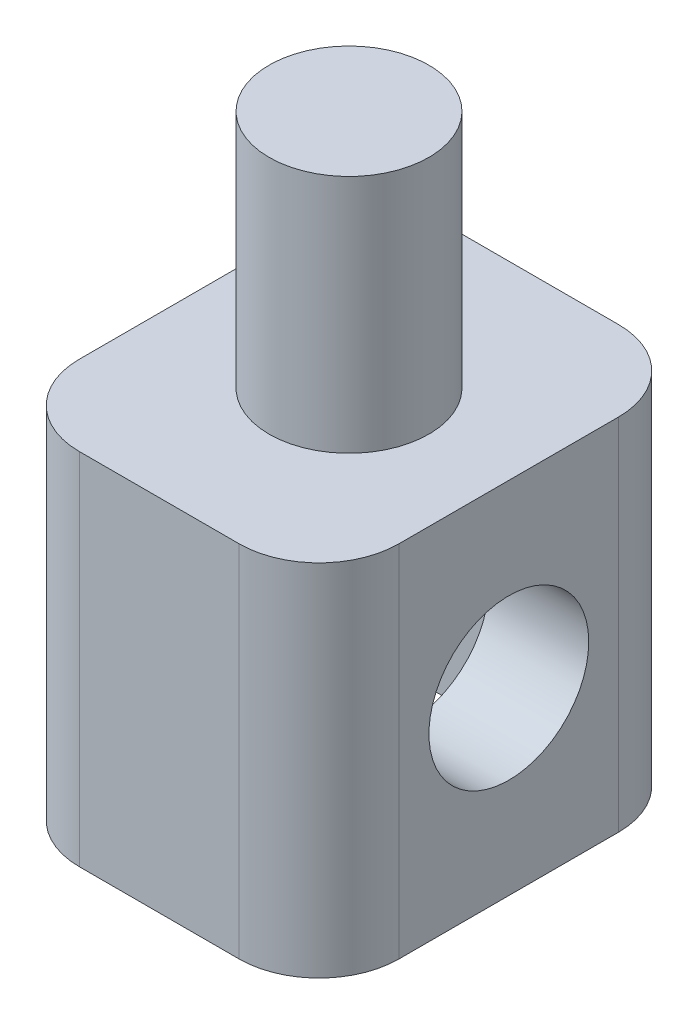
ISO-10303-21;
HEADER;
FILE_DESCRIPTION(('STEP AP214'),'2;1');
FILE_NAME('part.step','',(''),(''),'','','');
FILE_SCHEMA(('AUTOMOTIVE_DESIGN { 1 0 10303 214 1 1 1 1 }'));
ENDSEC;
DATA;
#1=APPLICATION_CONTEXT('core data for automotive mechanical design processes');
#2=APPLICATION_PROTOCOL_DEFINITION('international standard','automotive_design',2000,#1);
#3=PRODUCT_CONTEXT('',#1,'mechanical');
#4=PRODUCT('Part','Part','',(#3));
#5=PRODUCT_RELATED_PRODUCT_CATEGORY('part','',(#4));
#6=PRODUCT_DEFINITION_FORMATION('','',#4);
#7=PRODUCT_DEFINITION_CONTEXT('part definition',#1,'design');
#8=PRODUCT_DEFINITION('design','',#6,#7);
#9=PRODUCT_DEFINITION_SHAPE('','',#8);
#10=(LENGTH_UNIT() NAMED_UNIT(*) SI_UNIT(.MILLI.,.METRE.));
#11=(NAMED_UNIT(*) PLANE_ANGLE_UNIT() SI_UNIT($,.RADIAN.));
#12=(NAMED_UNIT(*) SI_UNIT($,.STERADIAN.) SOLID_ANGLE_UNIT());
#13=UNCERTAINTY_MEASURE_WITH_UNIT(LENGTH_MEASURE(1.E-05),#10,'distance_accuracy_value','');
#14=(GEOMETRIC_REPRESENTATION_CONTEXT(3) GLOBAL_UNCERTAINTY_ASSIGNED_CONTEXT((#13)) GLOBAL_UNIT_ASSIGNED_CONTEXT((#10,
#11,#12)) REPRESENTATION_CONTEXT('',''));
#15=CARTESIAN_POINT('',(0.,0.,0.));
#16=DIRECTION('',(0.,0.,1.));
#17=DIRECTION('',(1.,0.,0.));
#18=AXIS2_PLACEMENT_3D('',#15,#16,#17);
#19=CARTESIAN_POINT('',(0.,-4.5,0.));
#20=DIRECTION('',(0.,1.,0.));
#21=DIRECTION('',(0.,0.,1.));
#22=AXIS2_PLACEMENT_3D('',#19,#20,#21);
#23=PLANE('',#22);
#24=DIRECTION('',(-1.,0.,0.));
#25=VECTOR('',#24,1.);
#26=CARTESIAN_POINT('',(4.,-4.5,-4.75));
#27=LINE('',#26,#25);
#28=CARTESIAN_POINT('',(2.,-4.5,-4.75));
#29=VERTEX_POINT('',#28);
#30=CARTESIAN_POINT('',(-2.,-4.5,-4.75));
#31=VERTEX_POINT('',#30);
#32=EDGE_CURVE('E191',#29,#31,#27,.T.);
#33=ORIENTED_EDGE('',*,*,#32,.F.);
#34=CARTESIAN_POINT('',(2.,-4.5,-2.75));
#35=DIRECTION('',(0.,1.,0.));
#36=DIRECTION('',(0.,0.,1.));
#37=AXIS2_PLACEMENT_3D('',#34,#35,#36);
#38=CIRCLE('',#37,2.);
#39=CARTESIAN_POINT('',(4.,-4.5,-2.75));
#40=VERTEX_POINT('',#39);
#41=EDGE_CURVE('E223',#29,#40,#38,.F.);
#42=ORIENTED_EDGE('',*,*,#41,.T.);
#43=DIRECTION('',(0.,0.,-1.));
#44=VECTOR('',#43,1.);
#45=CARTESIAN_POINT('',(4.,-4.5,4.75));
#46=LINE('',#45,#44);
#47=CARTESIAN_POINT('',(4.,-4.5,2.75));
#48=VERTEX_POINT('',#47);
#49=EDGE_CURVE('E204',#48,#40,#46,.T.);
#50=ORIENTED_EDGE('',*,*,#49,.F.);
#51=CARTESIAN_POINT('',(2.,-4.5,2.75));
#52=DIRECTION('',(0.,1.,0.));
#53=DIRECTION('',(0.,0.,1.));
#54=AXIS2_PLACEMENT_3D('',#51,#52,#53);
#55=CIRCLE('',#54,2.);
#56=CARTESIAN_POINT('',(2.,-4.5,4.75));
#57=VERTEX_POINT('',#56);
#58=EDGE_CURVE('E217',#48,#57,#55,.F.);
#59=ORIENTED_EDGE('',*,*,#58,.T.);
#60=DIRECTION('',(1.,0.,0.));
#61=VECTOR('',#60,1.);
#62=CARTESIAN_POINT('',(4.,-4.5,4.75));
#63=LINE('',#62,#61);
#64=CARTESIAN_POINT('',(-2.,-4.5,4.75));
#65=VERTEX_POINT('',#64);
#66=EDGE_CURVE('E202',#65,#57,#63,.T.);
#67=ORIENTED_EDGE('',*,*,#66,.F.);
#68=CARTESIAN_POINT('',(-2.,-4.5,2.75));
#69=DIRECTION('',(0.,1.,0.));
#70=DIRECTION('',(0.,0.,1.));
#71=AXIS2_PLACEMENT_3D('',#68,#69,#70);
#72=CIRCLE('',#71,2.);
#73=CARTESIAN_POINT('',(-4.,-4.5,2.75));
#74=VERTEX_POINT('',#73);
#75=EDGE_CURVE('E219',#65,#74,#72,.F.);
#76=ORIENTED_EDGE('',*,*,#75,.T.);
#77=DIRECTION('',(0.,0.,1.));
#78=VECTOR('',#77,1.);
#79=CARTESIAN_POINT('',(-4.,-4.5,4.75));
#80=LINE('',#79,#78);
#81=CARTESIAN_POINT('',(-4.,-4.5,-2.75));
#82=VERTEX_POINT('',#81);
#83=EDGE_CURVE('E185',#82,#74,#80,.T.);
#84=ORIENTED_EDGE('',*,*,#83,.F.);
#85=CARTESIAN_POINT('',(-2.,-4.5,-2.75));
#86=DIRECTION('',(0.,1.,0.));
#87=DIRECTION('',(0.,0.,1.));
#88=AXIS2_PLACEMENT_3D('',#85,#86,#87);
#89=CIRCLE('',#88,2.);
#90=EDGE_CURVE('E221',#82,#31,#89,.F.);
#91=ORIENTED_EDGE('',*,*,#90,.T.);
#92=EDGE_LOOP('',(#33,#42,#50,#59,#67,#76,#84,#91));
#93=FACE_BOUND('',#92,.T.);
#94=DIRECTION('',(0.,0.,-1.));
#95=VECTOR('',#94,1.);
#96=CARTESIAN_POINT('',(-1.5,-4.5,3.5));
#97=LINE('',#96,#95);
#98=CARTESIAN_POINT('',(-1.5,-4.5,3.5));
#99=VERTEX_POINT('',#98);
#100=CARTESIAN_POINT('',(-1.5,-4.5,-3.5));
#101=VERTEX_POINT('',#100);
#102=EDGE_CURVE('E162',#99,#101,#97,.T.);
#103=ORIENTED_EDGE('',*,*,#102,.F.);
#104=DIRECTION('',(1.,0.,0.));
#105=VECTOR('',#104,1.);
#106=CARTESIAN_POINT('',(-1.5,-4.5,3.5));
#107=LINE('',#106,#105);
#108=CARTESIAN_POINT('',(1.5,-4.5,3.5));
#109=VERTEX_POINT('',#108);
#110=EDGE_CURVE('E178',#99,#109,#107,.T.);
#111=ORIENTED_EDGE('',*,*,#110,.T.);
#112=DIRECTION('',(0.,0.,-1.));
#113=VECTOR('',#112,1.);
#114=CARTESIAN_POINT('',(1.5,-4.5,3.5));
#115=LINE('',#114,#113);
#116=CARTESIAN_POINT('',(1.5,-4.5,-3.5));
#117=VERTEX_POINT('',#116);
#118=EDGE_CURVE('E155',#109,#117,#115,.T.);
#119=ORIENTED_EDGE('',*,*,#118,.T.);
#120=DIRECTION('',(1.,0.,0.));
#121=VECTOR('',#120,1.);
#122=CARTESIAN_POINT('',(-1.5,-4.5,-3.5));
#123=LINE('',#122,#121);
#124=EDGE_CURVE('E176',#101,#117,#123,.T.);
#125=ORIENTED_EDGE('',*,*,#124,.F.);
#126=EDGE_LOOP('',(#103,#111,#119,#125));
#127=FACE_BOUND('',#126,.T.);
#128=ADVANCED_FACE('F32',(#93,#127),#23,.F.);
#129=CARTESIAN_POINT('',(-4.,4.5,4.75));
#130=DIRECTION('',(1.,0.,0.));
#131=DIRECTION('',(0.,0.,-1.));
#132=AXIS2_PLACEMENT_3D('',#129,#130,#131);
#133=PLANE('',#132);
#134=CARTESIAN_POINT('',(-4.,0.,0.));
#135=DIRECTION('',(1.,0.,0.));
#136=DIRECTION('',(0.,0.,-1.));
#137=AXIS2_PLACEMENT_3D('',#134,#135,#136);
#138=CIRCLE('',#137,2.);
#139=CARTESIAN_POINT('',(-4.,0.,-2.));
#140=VERTEX_POINT('',#139);
#141=EDGE_CURVE('E212',#140,#140,#138,.T.);
#142=ORIENTED_EDGE('',*,*,#141,.T.);
#143=EDGE_LOOP('',(#142));
#144=FACE_BOUND('',#143,.T.);
#145=DIRECTION('',(0.,0.,1.));
#146=VECTOR('',#145,1.);
#147=CARTESIAN_POINT('',(-4.,4.5,4.75));
#148=LINE('',#147,#146);
#149=CARTESIAN_POINT('',(-4.,4.5,-2.75));
#150=VERTEX_POINT('',#149);
#151=CARTESIAN_POINT('',(-4.,4.5,2.75));
#152=VERTEX_POINT('',#151);
#153=EDGE_CURVE('E188',#150,#152,#148,.T.);
#154=ORIENTED_EDGE('',*,*,#153,.F.);
#155=DIRECTION('',(0.,-1.,0.));
#156=VECTOR('',#155,1.);
#157=CARTESIAN_POINT('',(-4.,4.5,-2.75));
#158=LINE('',#157,#156);
#159=EDGE_CURVE('E239',#150,#82,#158,.T.);
#160=ORIENTED_EDGE('',*,*,#159,.T.);
#161=ORIENTED_EDGE('',*,*,#83,.T.);
#162=DIRECTION('',(0.,-1.,0.));
#163=VECTOR('',#162,1.);
#164=CARTESIAN_POINT('',(-4.,4.5,2.75));
#165=LINE('',#164,#163);
#166=EDGE_CURVE('E237',#74,#152,#165,.F.);
#167=ORIENTED_EDGE('',*,*,#166,.T.);
#168=EDGE_LOOP('',(#154,#160,#161,#167));
#169=FACE_BOUND('',#168,.T.);
#170=ADVANCED_FACE('F245',(#144,#169),#133,.F.);
#171=CARTESIAN_POINT('',(4.,4.5,4.75));
#172=DIRECTION('',(0.,0.,-1.));
#173=DIRECTION('',(-1.,0.,0.));
#174=AXIS2_PLACEMENT_3D('',#171,#172,#173);
#175=PLANE('',#174);
#176=DIRECTION('',(1.,0.,0.));
#177=VECTOR('',#176,1.);
#178=CARTESIAN_POINT('',(4.,4.5,4.75));
#179=LINE('',#178,#177);
#180=CARTESIAN_POINT('',(-2.,4.5,4.75));
#181=VERTEX_POINT('',#180);
#182=CARTESIAN_POINT('',(2.,4.5,4.75));
#183=VERTEX_POINT('',#182);
#184=EDGE_CURVE('E190',#181,#183,#179,.T.);
#185=ORIENTED_EDGE('',*,*,#184,.F.);
#186=DIRECTION('',(0.,-1.,0.));
#187=VECTOR('',#186,1.);
#188=CARTESIAN_POINT('',(-2.,4.5,4.75));
#189=LINE('',#188,#187);
#190=EDGE_CURVE('E11',#181,#65,#189,.T.);
#191=ORIENTED_EDGE('',*,*,#190,.T.);
#192=ORIENTED_EDGE('',*,*,#66,.T.);
#193=DIRECTION('',(0.,-1.,0.));
#194=VECTOR('',#193,1.);
#195=CARTESIAN_POINT('',(2.,4.5,4.75));
#196=LINE('',#195,#194);
#197=EDGE_CURVE('E40',#57,#183,#196,.F.);
#198=ORIENTED_EDGE('',*,*,#197,.T.);
#199=EDGE_LOOP('',(#185,#191,#192,#198));
#200=FACE_BOUND('',#199,.T.);
#201=ADVANCED_FACE('F256',(#200),#175,.F.);
#202=CARTESIAN_POINT('',(4.,4.5,4.75));
#203=DIRECTION('',(-1.,0.,0.));
#204=DIRECTION('',(0.,0.,1.));
#205=AXIS2_PLACEMENT_3D('',#202,#203,#204);
#206=PLANE('',#205);
#207=CARTESIAN_POINT('',(4.,0.,0.));
#208=DIRECTION('',(1.,0.,0.));
#209=DIRECTION('',(0.,0.,-1.));
#210=AXIS2_PLACEMENT_3D('',#207,#208,#209);
#211=CIRCLE('',#210,2.);
#212=CARTESIAN_POINT('',(4.,0.,-2.));
#213=VERTEX_POINT('',#212);
#214=EDGE_CURVE('E461',#213,#213,#211,.T.);
#215=ORIENTED_EDGE('',*,*,#214,.F.);
#216=EDGE_LOOP('',(#215));
#217=FACE_BOUND('',#216,.T.);
#218=ORIENTED_EDGE('',*,*,#49,.T.);
#219=DIRECTION('',(0.,-1.,0.));
#220=VECTOR('',#219,1.);
#221=CARTESIAN_POINT('',(4.,4.5,-2.75));
#222=LINE('',#221,#220);
#223=CARTESIAN_POINT('',(4.,4.5,-2.75));
#224=VERTEX_POINT('',#223);
#225=EDGE_CURVE('E228',#40,#224,#222,.F.);
#226=ORIENTED_EDGE('',*,*,#225,.T.);
#227=DIRECTION('',(0.,0.,-1.));
#228=VECTOR('',#227,1.);
#229=CARTESIAN_POINT('',(4.,4.5,4.75));
#230=LINE('',#229,#228);
#231=CARTESIAN_POINT('',(4.,4.5,2.75));
#232=VERTEX_POINT('',#231);
#233=EDGE_CURVE('E193',#232,#224,#230,.T.);
#234=ORIENTED_EDGE('',*,*,#233,.F.);
#235=DIRECTION('',(0.,-1.,0.));
#236=VECTOR('',#235,1.);
#237=CARTESIAN_POINT('',(4.,4.5,2.75));
#238=LINE('',#237,#236);
#239=EDGE_CURVE('E225',#232,#48,#238,.T.);
#240=ORIENTED_EDGE('',*,*,#239,.T.);
#241=EDGE_LOOP('',(#218,#226,#234,#240));
#242=FACE_BOUND('',#241,.T.);
#243=ADVANCED_FACE('F264',(#217,#242),#206,.F.);
#244=CARTESIAN_POINT('',(4.,4.5,-4.75));
#245=DIRECTION('',(0.,0.,1.));
#246=DIRECTION('',(1.,0.,0.));
#247=AXIS2_PLACEMENT_3D('',#244,#245,#246);
#248=PLANE('',#247);
#249=DIRECTION('',(-1.,0.,0.));
#250=VECTOR('',#249,1.);
#251=CARTESIAN_POINT('',(4.,4.5,-4.75));
#252=LINE('',#251,#250);
#253=CARTESIAN_POINT('',(2.,4.5,-4.75));
#254=VERTEX_POINT('',#253);
#255=CARTESIAN_POINT('',(-2.,4.5,-4.75));
#256=VERTEX_POINT('',#255);
#257=EDGE_CURVE('E196',#254,#256,#252,.T.);
#258=ORIENTED_EDGE('',*,*,#257,.F.);
#259=DIRECTION('',(0.,-1.,0.));
#260=VECTOR('',#259,1.);
#261=CARTESIAN_POINT('',(2.,4.5,-4.75));
#262=LINE('',#261,#260);
#263=EDGE_CURVE('E214',#254,#29,#262,.T.);
#264=ORIENTED_EDGE('',*,*,#263,.T.);
#265=ORIENTED_EDGE('',*,*,#32,.T.);
#266=DIRECTION('',(0.,-1.,0.));
#267=VECTOR('',#266,1.);
#268=CARTESIAN_POINT('',(-2.,4.5,-4.75));
#269=LINE('',#268,#267);
#270=EDGE_CURVE('E199',#31,#256,#269,.F.);
#271=ORIENTED_EDGE('',*,*,#270,.T.);
#272=EDGE_LOOP('',(#258,#264,#265,#271));
#273=FACE_BOUND('',#272,.T.);
#274=ADVANCED_FACE('F272',(#273),#248,.F.);
#275=CARTESIAN_POINT('',(0.,4.5,0.));
#276=DIRECTION('',(0.,1.,0.));
#277=DIRECTION('',(0.,0.,1.));
#278=AXIS2_PLACEMENT_3D('',#275,#276,#277);
#279=PLANE('',#278);
#280=CARTESIAN_POINT('',(0.,4.5,0.));
#281=DIRECTION('',(0.,1.,0.));
#282=DIRECTION('',(0.,0.,1.));
#283=AXIS2_PLACEMENT_3D('',#280,#281,#282);
#284=CIRCLE('',#283,2.);
#285=CARTESIAN_POINT('',(0.,4.5,2.));
#286=VERTEX_POINT('',#285);
#287=EDGE_CURVE('E175',#286,#286,#284,.T.);
#288=ORIENTED_EDGE('',*,*,#287,.F.);
#289=EDGE_LOOP('',(#288));
#290=FACE_BOUND('',#289,.T.);
#291=ORIENTED_EDGE('',*,*,#233,.T.);
#292=CARTESIAN_POINT('',(2.,4.5,-2.75));
#293=DIRECTION('',(0.,1.,0.));
#294=DIRECTION('',(0.,0.,1.));
#295=AXIS2_PLACEMENT_3D('',#292,#293,#294);
#296=CIRCLE('',#295,2.);
#297=EDGE_CURVE('E235',#224,#254,#296,.T.);
#298=ORIENTED_EDGE('',*,*,#297,.T.);
#299=ORIENTED_EDGE('',*,*,#257,.T.);
#300=CARTESIAN_POINT('',(-2.,4.5,-2.75));
#301=DIRECTION('',(0.,1.,0.));
#302=DIRECTION('',(0.,0.,1.));
#303=AXIS2_PLACEMENT_3D('',#300,#301,#302);
#304=CIRCLE('',#303,2.);
#305=EDGE_CURVE('E233',#256,#150,#304,.T.);
#306=ORIENTED_EDGE('',*,*,#305,.T.);
#307=ORIENTED_EDGE('',*,*,#153,.T.);
#308=CARTESIAN_POINT('',(-2.,4.5,2.75));
#309=DIRECTION('',(0.,1.,0.));
#310=DIRECTION('',(0.,0.,1.));
#311=AXIS2_PLACEMENT_3D('',#308,#309,#310);
#312=CIRCLE('',#311,2.);
#313=EDGE_CURVE('E53',#152,#181,#312,.T.);
#314=ORIENTED_EDGE('',*,*,#313,.T.);
#315=ORIENTED_EDGE('',*,*,#184,.T.);
#316=CARTESIAN_POINT('',(2.,4.5,2.75));
#317=DIRECTION('',(0.,1.,0.));
#318=DIRECTION('',(0.,0.,1.));
#319=AXIS2_PLACEMENT_3D('',#316,#317,#318);
#320=CIRCLE('',#319,2.);
#321=EDGE_CURVE('E230',#183,#232,#320,.T.);
#322=ORIENTED_EDGE('',*,*,#321,.T.);
#323=EDGE_LOOP('',(#291,#298,#299,#306,#307,#314,#315,#322));
#324=FACE_BOUND('',#323,.T.);
#325=ADVANCED_FACE('F258',(#290,#324),#279,.T.);
#326=CARTESIAN_POINT('',(0.,10.5,0.));
#327=DIRECTION('',(0.,-1.,0.));
#328=DIRECTION('',(0.,0.,-1.));
#329=AXIS2_PLACEMENT_3D('',#326,#327,#328);
#330=CYLINDRICAL_SURFACE('',#329,2.);
#331=CARTESIAN_POINT('',(0.,10.5,0.));
#332=DIRECTION('',(0.,1.,0.));
#333=DIRECTION('',(0.,0.,1.));
#334=AXIS2_PLACEMENT_3D('',#331,#332,#333);
#335=CIRCLE('',#334,2.);
#336=CARTESIAN_POINT('',(0.,10.5,2.));
#337=VERTEX_POINT('',#336);
#338=EDGE_CURVE('E182',#337,#337,#335,.T.);
#339=ORIENTED_EDGE('',*,*,#338,.F.);
#340=EDGE_LOOP('',(#339));
#341=FACE_BOUND('',#340,.T.);
#342=ORIENTED_EDGE('',*,*,#287,.T.);
#343=EDGE_LOOP('',(#342));
#344=FACE_BOUND('',#343,.T.);
#345=ADVANCED_FACE('F317',(#341,#344),#330,.T.);
#346=CARTESIAN_POINT('',(0.,10.5,0.));
#347=DIRECTION('',(0.,1.,0.));
#348=DIRECTION('',(0.,0.,1.));
#349=AXIS2_PLACEMENT_3D('',#346,#347,#348);
#350=PLANE('',#349);
#351=ORIENTED_EDGE('',*,*,#338,.T.);
#352=EDGE_LOOP('',(#351));
#353=FACE_BOUND('',#352,.T.);
#354=ADVANCED_FACE('F325',(#353),#350,.T.);
#355=CARTESIAN_POINT('',(-1.5,2.02072594216369,-3.5));
#356=DIRECTION('',(0.,0.866025403784439,-0.5));
#357=DIRECTION('',(0.,0.5,0.866025403784439));
#358=AXIS2_PLACEMENT_3D('',#355,#356,#357);
#359=PLANE('',#358);
#360=DIRECTION('',(0.,0.5,0.866025403784439));
#361=VECTOR('',#360,1.);
#362=CARTESIAN_POINT('',(1.5,2.02072594216369,-3.5));
#363=LINE('',#362,#361);
#364=CARTESIAN_POINT('',(1.5,2.02072594216369,-3.5));
#365=VERTEX_POINT('',#364);
#366=CARTESIAN_POINT('',(1.5,4.04145188432738,0.));
#367=VERTEX_POINT('',#366);
#368=EDGE_CURVE('E134',#365,#367,#363,.T.);
#369=ORIENTED_EDGE('',*,*,#368,.T.);
#370=DIRECTION('',(1.,0.,0.));
#371=VECTOR('',#370,1.);
#372=CARTESIAN_POINT('',(-1.5,4.04145188432738,0.));
#373=LINE('',#372,#371);
#374=CARTESIAN_POINT('',(-1.5,4.04145188432738,0.));
#375=VERTEX_POINT('',#374);
#376=EDGE_CURVE('E128',#375,#367,#373,.T.);
#377=ORIENTED_EDGE('',*,*,#376,.F.);
#378=DIRECTION('',(0.,0.5,0.866025403784439));
#379=VECTOR('',#378,1.);
#380=CARTESIAN_POINT('',(-1.5,2.02072594216369,-3.5));
#381=LINE('',#380,#379);
#382=CARTESIAN_POINT('',(-1.5,2.02072594216369,-3.5));
#383=VERTEX_POINT('',#382);
#384=EDGE_CURVE('E132',#383,#375,#381,.T.);
#385=ORIENTED_EDGE('',*,*,#384,.F.);
#386=DIRECTION('',(1.,0.,0.));
#387=VECTOR('',#386,1.);
#388=CARTESIAN_POINT('',(-1.5,2.02072594216369,-3.5));
#389=LINE('',#388,#387);
#390=EDGE_CURVE('E173',#383,#365,#389,.T.);
#391=ORIENTED_EDGE('',*,*,#390,.T.);
#392=EDGE_LOOP('',(#369,#377,#385,#391));
#393=FACE_BOUND('',#392,.T.);
#394=ADVANCED_FACE('F130',(#393),#359,.F.);
#395=CARTESIAN_POINT('',(-1.5,-2.02072594216369,-3.5));
#396=DIRECTION('',(0.,0.,-1.));
#397=DIRECTION('',(-1.,0.,0.));
#398=AXIS2_PLACEMENT_3D('',#395,#396,#397);
#399=PLANE('',#398);
#400=DIRECTION('',(0.,1.,0.));
#401=VECTOR('',#400,1.);
#402=CARTESIAN_POINT('',(1.5,-2.02072594216369,-3.5));
#403=LINE('',#402,#401);
#404=EDGE_CURVE('E152',#117,#365,#403,.T.);
#405=ORIENTED_EDGE('',*,*,#404,.T.);
#406=ORIENTED_EDGE('',*,*,#390,.F.);
#407=DIRECTION('',(0.,1.,0.));
#408=VECTOR('',#407,1.);
#409=CARTESIAN_POINT('',(-1.5,-4.5,-3.5));
#410=LINE('',#409,#408);
#411=EDGE_CURVE('E139',#101,#383,#410,.T.);
#412=ORIENTED_EDGE('',*,*,#411,.F.);
#413=ORIENTED_EDGE('',*,*,#124,.T.);
#414=EDGE_LOOP('',(#405,#406,#412,#413));
#415=FACE_BOUND('',#414,.T.);
#416=ADVANCED_FACE('F339',(#415),#399,.F.);
#417=CARTESIAN_POINT('',(-1.5,-2.02072594216369,3.5));
#418=DIRECTION('',(0.,0.,1.));
#419=DIRECTION('',(1.,0.,0.));
#420=AXIS2_PLACEMENT_3D('',#417,#418,#419);
#421=PLANE('',#420);
#422=DIRECTION('',(0.,-1.,0.));
#423=VECTOR('',#422,1.);
#424=CARTESIAN_POINT('',(1.5,-2.02072594216369,3.5));
#425=LINE('',#424,#423);
#426=CARTESIAN_POINT('',(1.5,2.02072594216369,3.5));
#427=VERTEX_POINT('',#426);
#428=EDGE_CURVE('E168',#427,#109,#425,.T.);
#429=ORIENTED_EDGE('',*,*,#428,.T.);
#430=ORIENTED_EDGE('',*,*,#110,.F.);
#431=DIRECTION('',(0.,-1.,0.));
#432=VECTOR('',#431,1.);
#433=CARTESIAN_POINT('',(-1.5,2.02072594216369,3.5));
#434=LINE('',#433,#432);
#435=CARTESIAN_POINT('',(-1.5,2.02072594216369,3.5));
#436=VERTEX_POINT('',#435);
#437=EDGE_CURVE('E147',#436,#99,#434,.T.);
#438=ORIENTED_EDGE('',*,*,#437,.F.);
#439=DIRECTION('',(1.,0.,0.));
#440=VECTOR('',#439,1.);
#441=CARTESIAN_POINT('',(-1.5,2.02072594216369,3.5));
#442=LINE('',#441,#440);
#443=EDGE_CURVE('E138',#436,#427,#442,.T.);
#444=ORIENTED_EDGE('',*,*,#443,.T.);
#445=EDGE_LOOP('',(#429,#430,#438,#444));
#446=FACE_BOUND('',#445,.T.);
#447=ADVANCED_FACE('F346',(#446),#421,.F.);
#448=CARTESIAN_POINT('',(-1.5,4.04145188432738,0.));
#449=DIRECTION('',(0.,0.866025403784439,0.5));
#450=DIRECTION('',(0.,-0.5,0.866025403784439));
#451=AXIS2_PLACEMENT_3D('',#448,#449,#450);
#452=PLANE('',#451);
#453=DIRECTION('',(0.,-0.5,0.866025403784439));
#454=VECTOR('',#453,1.);
#455=CARTESIAN_POINT('',(1.5,4.04145188432738,0.));
#456=LINE('',#455,#454);
#457=EDGE_CURVE('E166',#367,#427,#456,.T.);
#458=ORIENTED_EDGE('',*,*,#457,.T.);
#459=ORIENTED_EDGE('',*,*,#443,.F.);
#460=DIRECTION('',(0.,-0.5,0.866025403784439));
#461=VECTOR('',#460,1.);
#462=CARTESIAN_POINT('',(-1.5,4.04145188432738,0.));
#463=LINE('',#462,#461);
#464=EDGE_CURVE('E142',#375,#436,#463,.T.);
#465=ORIENTED_EDGE('',*,*,#464,.F.);
#466=ORIENTED_EDGE('',*,*,#376,.T.);
#467=EDGE_LOOP('',(#458,#459,#465,#466));
#468=FACE_BOUND('',#467,.T.);
#469=ADVANCED_FACE('F143',(#468),#452,.F.);
#470=CARTESIAN_POINT('',(-1.5,0.,0.));
#471=DIRECTION('',(1.,0.,0.));
#472=DIRECTION('',(0.,0.,-1.));
#473=AXIS2_PLACEMENT_3D('',#470,#471,#472);
#474=PLANE('',#473);
#475=CARTESIAN_POINT('',(-1.5,0.,0.));
#476=DIRECTION('',(1.,0.,0.));
#477=DIRECTION('',(0.,0.,-1.));
#478=AXIS2_PLACEMENT_3D('',#475,#476,#477);
#479=CIRCLE('',#478,2.);
#480=CARTESIAN_POINT('',(-1.5,0.,-2.));
#481=VERTEX_POINT('',#480);
#482=EDGE_CURVE('E158',#481,#481,#479,.T.);
#483=ORIENTED_EDGE('',*,*,#482,.F.);
#484=EDGE_LOOP('',(#483));
#485=FACE_BOUND('',#484,.T.);
#486=ORIENTED_EDGE('',*,*,#384,.T.);
#487=ORIENTED_EDGE('',*,*,#464,.T.);
#488=ORIENTED_EDGE('',*,*,#437,.T.);
#489=ORIENTED_EDGE('',*,*,#102,.T.);
#490=ORIENTED_EDGE('',*,*,#411,.T.);
#491=EDGE_LOOP('',(#486,#487,#488,#489,#490));
#492=FACE_BOUND('',#491,.T.);
#493=ADVANCED_FACE('F149',(#485,#492),#474,.T.);
#494=CARTESIAN_POINT('',(1.5,0.,0.));
#495=DIRECTION('',(1.,0.,0.));
#496=DIRECTION('',(0.,0.,-1.));
#497=AXIS2_PLACEMENT_3D('',#494,#495,#496);
#498=PLANE('',#497);
#499=CARTESIAN_POINT('',(1.5,0.,0.));
#500=DIRECTION('',(1.,0.,0.));
#501=DIRECTION('',(0.,0.,-1.));
#502=AXIS2_PLACEMENT_3D('',#499,#500,#501);
#503=CIRCLE('',#502,2.);
#504=CARTESIAN_POINT('',(1.5,0.,-2.));
#505=VERTEX_POINT('',#504);
#506=EDGE_CURVE('E209',#505,#505,#503,.T.);
#507=ORIENTED_EDGE('',*,*,#506,.T.);
#508=EDGE_LOOP('',(#507));
#509=FACE_BOUND('',#508,.T.);
#510=ORIENTED_EDGE('',*,*,#368,.F.);
#511=ORIENTED_EDGE('',*,*,#404,.F.);
#512=ORIENTED_EDGE('',*,*,#118,.F.);
#513=ORIENTED_EDGE('',*,*,#428,.F.);
#514=ORIENTED_EDGE('',*,*,#457,.F.);
#515=EDGE_LOOP('',(#510,#511,#512,#513,#514));
#516=FACE_BOUND('',#515,.T.);
#517=ADVANCED_FACE('F367',(#509,#516),#498,.F.);
#518=CARTESIAN_POINT('',(-4.,0.,0.));
#519=DIRECTION('',(1.,0.,0.));
#520=DIRECTION('',(0.,0.,-1.));
#521=AXIS2_PLACEMENT_3D('',#518,#519,#520);
#522=CYLINDRICAL_SURFACE('',#521,2.);
#523=ORIENTED_EDGE('',*,*,#214,.T.);
#524=EDGE_LOOP('',(#523));
#525=FACE_BOUND('',#524,.T.);
#526=ORIENTED_EDGE('',*,*,#506,.F.);
#527=EDGE_LOOP('',(#526));
#528=FACE_BOUND('',#527,.T.);
#529=ADVANCED_FACE('F375',(#525,#528),#522,.F.);
#530=ORIENTED_EDGE('',*,*,#482,.T.);
#531=EDGE_LOOP('',(#530));
#532=FACE_BOUND('',#531,.T.);
#533=ORIENTED_EDGE('',*,*,#141,.F.);
#534=EDGE_LOOP('',(#533));
#535=FACE_BOUND('',#534,.T.);
#536=ADVANCED_FACE('F281',(#532,#535),#522,.F.);
#537=CARTESIAN_POINT('',(2.,4.5,-2.75));
#538=DIRECTION('',(0.,-1.,0.));
#539=DIRECTION('',(0.,0.,-1.));
#540=AXIS2_PLACEMENT_3D('',#537,#538,#539);
#541=CYLINDRICAL_SURFACE('',#540,2.);
#542=ORIENTED_EDGE('',*,*,#297,.F.);
#543=ORIENTED_EDGE('',*,*,#225,.F.);
#544=ORIENTED_EDGE('',*,*,#41,.F.);
#545=ORIENTED_EDGE('',*,*,#263,.F.);
#546=EDGE_LOOP('',(#542,#543,#544,#545));
#547=FACE_BOUND('',#546,.T.);
#548=ADVANCED_FACE('F269',(#547),#541,.T.);
#549=CARTESIAN_POINT('',(-2.,4.5,-2.75));
#550=DIRECTION('',(0.,-1.,0.));
#551=DIRECTION('',(0.,0.,-1.));
#552=AXIS2_PLACEMENT_3D('',#549,#550,#551);
#553=CYLINDRICAL_SURFACE('',#552,2.);
#554=ORIENTED_EDGE('',*,*,#305,.F.);
#555=ORIENTED_EDGE('',*,*,#270,.F.);
#556=ORIENTED_EDGE('',*,*,#90,.F.);
#557=ORIENTED_EDGE('',*,*,#159,.F.);
#558=EDGE_LOOP('',(#554,#555,#556,#557));
#559=FACE_BOUND('',#558,.T.);
#560=ADVANCED_FACE('F274',(#559),#553,.T.);
#561=CARTESIAN_POINT('',(-2.,4.5,2.75));
#562=DIRECTION('',(0.,-1.,0.));
#563=DIRECTION('',(0.,0.,-1.));
#564=AXIS2_PLACEMENT_3D('',#561,#562,#563);
#565=CYLINDRICAL_SURFACE('',#564,2.);
#566=ORIENTED_EDGE('',*,*,#313,.F.);
#567=ORIENTED_EDGE('',*,*,#166,.F.);
#568=ORIENTED_EDGE('',*,*,#75,.F.);
#569=ORIENTED_EDGE('',*,*,#190,.F.);
#570=EDGE_LOOP('',(#566,#567,#568,#569));
#571=FACE_BOUND('',#570,.T.);
#572=ADVANCED_FACE('F255',(#571),#565,.T.);
#573=CARTESIAN_POINT('',(2.,4.5,2.75));
#574=DIRECTION('',(0.,-1.,0.));
#575=DIRECTION('',(0.,0.,-1.));
#576=AXIS2_PLACEMENT_3D('',#573,#574,#575);
#577=CYLINDRICAL_SURFACE('',#576,2.);
#578=ORIENTED_EDGE('',*,*,#321,.F.);
#579=ORIENTED_EDGE('',*,*,#197,.F.);
#580=ORIENTED_EDGE('',*,*,#58,.F.);
#581=ORIENTED_EDGE('',*,*,#239,.F.);
#582=EDGE_LOOP('',(#578,#579,#580,#581));
#583=FACE_BOUND('',#582,.T.);
#584=ADVANCED_FACE('F34',(#583),#577,.T.);
#585=CLOSED_SHELL('',(#128,#170,#201,#243,#274,#325,#345,#354,#394,#416,#447,#469,#493,#517,
#529,#536,#548,#560,#572,#584));
#586=MANIFOLD_SOLID_BREP('B2',#585);
#587=ADVANCED_BREP_SHAPE_REPRESENTATION('',(#18,#586),#14);
#588=SHAPE_DEFINITION_REPRESENTATION(#9,#587);
ENDSEC;
END-ISO-10303-21;
